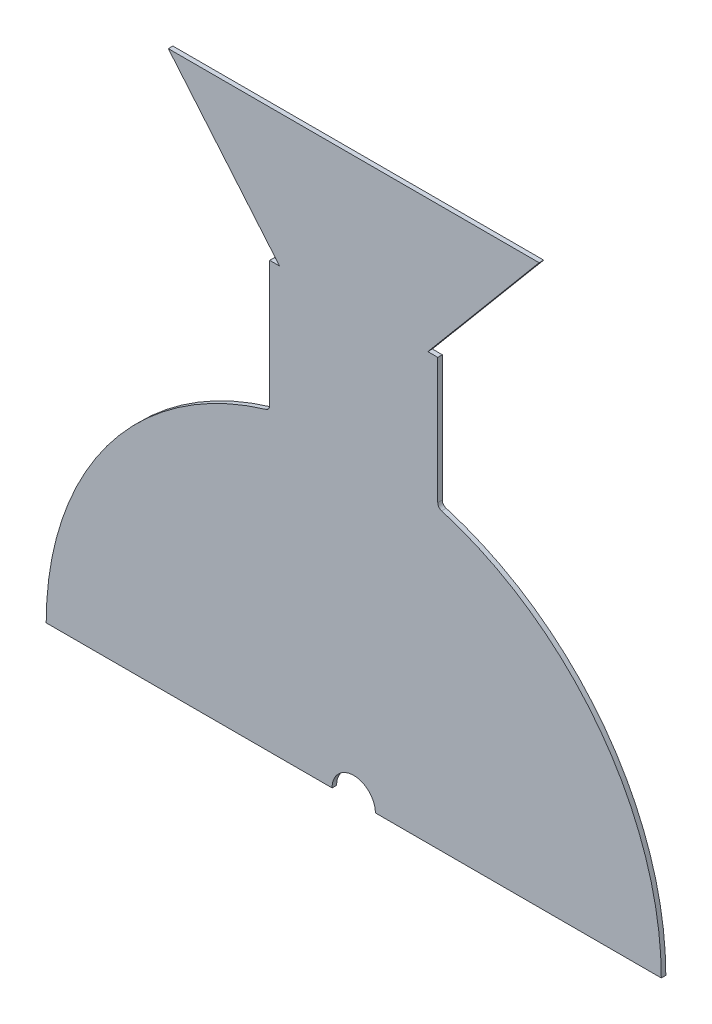
ISO-10303-21;
HEADER;
FILE_DESCRIPTION(('STEP AP214'),'2;1');
FILE_NAME('part.step','',(''),(''),'','','');
FILE_SCHEMA(('AUTOMOTIVE_DESIGN { 1 0 10303 214 1 1 1 1 }'));
ENDSEC;
DATA;
#1=APPLICATION_CONTEXT('core data for automotive mechanical design processes');
#2=APPLICATION_PROTOCOL_DEFINITION('international standard','automotive_design',2000,#1);
#3=PRODUCT_CONTEXT('',#1,'mechanical');
#4=PRODUCT('Part','Part','',(#3));
#5=PRODUCT_RELATED_PRODUCT_CATEGORY('part','',(#4));
#6=PRODUCT_DEFINITION_FORMATION('','',#4);
#7=PRODUCT_DEFINITION_CONTEXT('part definition',#1,'design');
#8=PRODUCT_DEFINITION('design','',#6,#7);
#9=PRODUCT_DEFINITION_SHAPE('','',#8);
#10=(LENGTH_UNIT() NAMED_UNIT(*) SI_UNIT(.MILLI.,.METRE.));
#11=(NAMED_UNIT(*) PLANE_ANGLE_UNIT() SI_UNIT($,.RADIAN.));
#12=(NAMED_UNIT(*) SI_UNIT($,.STERADIAN.) SOLID_ANGLE_UNIT());
#13=UNCERTAINTY_MEASURE_WITH_UNIT(LENGTH_MEASURE(1.E-05),#10,'distance_accuracy_value','');
#14=(GEOMETRIC_REPRESENTATION_CONTEXT(3) GLOBAL_UNCERTAINTY_ASSIGNED_CONTEXT((#13)) GLOBAL_UNIT_ASSIGNED_CONTEXT((#10,
#11,#12)) REPRESENTATION_CONTEXT('',''));
#15=CARTESIAN_POINT('',(0.,0.,0.));
#16=DIRECTION('',(0.,0.,1.));
#17=DIRECTION('',(1.,0.,0.));
#18=AXIS2_PLACEMENT_3D('',#15,#16,#17);
#19=CARTESIAN_POINT('',(0.,0.,-2.65684));
#20=DIRECTION('',(0.,0.,1.));
#21=DIRECTION('',(1.,0.,0.));
#22=AXIS2_PLACEMENT_3D('',#19,#20,#21);
#23=CYLINDRICAL_SURFACE('',#22,180.45684);
#24=CARTESIAN_POINT('',(0.,0.,0.));
#25=DIRECTION('',(0.,0.,1.));
#26=DIRECTION('',(-1.,0.,0.));
#27=AXIS2_PLACEMENT_3D('',#24,#25,#26);
#28=CIRCLE('',#27,180.45684);
#29=CARTESIAN_POINT('',(-51.5590971428571,172.934469104916,0.));
#30=VERTEX_POINT('',#29);
#31=CARTESIAN_POINT('',(-180.45684,0.,0.));
#32=VERTEX_POINT('',#31);
#33=EDGE_CURVE('E187',#30,#32,#28,.T.);
#34=ORIENTED_EDGE('',*,*,#33,.F.);
#35=DIRECTION('',(0.,0.,1.));
#36=VECTOR('',#35,1.);
#37=CARTESIAN_POINT('',(-51.5590971428571,172.934469104916,-2.65684));
#38=LINE('',#37,#36);
#39=CARTESIAN_POINT('',(-51.5590971428571,172.934469104916,-2.65684));
#40=VERTEX_POINT('',#39);
#41=EDGE_CURVE('E54',#30,#40,#38,.F.);
#42=ORIENTED_EDGE('',*,*,#41,.T.);
#43=CARTESIAN_POINT('',(0.,0.,-2.65684));
#44=DIRECTION('',(0.,0.,1.));
#45=DIRECTION('',(-1.,0.,0.));
#46=AXIS2_PLACEMENT_3D('',#43,#44,#45);
#47=CIRCLE('',#46,180.45684);
#48=CARTESIAN_POINT('',(-180.45684,0.,-2.65684));
#49=VERTEX_POINT('',#48);
#50=EDGE_CURVE('E136',#40,#49,#47,.T.);
#51=ORIENTED_EDGE('',*,*,#50,.T.);
#52=DIRECTION('',(0.,0.,1.));
#53=VECTOR('',#52,1.);
#54=CARTESIAN_POINT('',(-180.45684,0.,-2.65684));
#55=LINE('',#54,#53);
#56=EDGE_CURVE('E138',#49,#32,#55,.T.);
#57=ORIENTED_EDGE('',*,*,#56,.T.);
#58=EDGE_LOOP('',(#34,#42,#51,#57));
#59=FACE_BOUND('',#58,.T.);
#60=ADVANCED_FACE('F39',(#59),#23,.T.);
#61=CARTESIAN_POINT('',(-49.29124,173.594483674015,-2.65684));
#62=DIRECTION('',(-1.,0.,0.));
#63=DIRECTION('',(0.,0.,1.));
#64=AXIS2_PLACEMENT_3D('',#61,#62,#63);
#65=PLANE('',#64);
#66=DIRECTION('',(0.,-1.,0.));
#67=VECTOR('',#66,1.);
#68=CARTESIAN_POINT('',(-49.29124,173.594483674015,-2.65684));
#69=LINE('',#68,#67);
#70=CARTESIAN_POINT('',(-49.29124,249.794483674015,-2.65684));
#71=VERTEX_POINT('',#70);
#72=CARTESIAN_POINT('',(-49.29124,175.977118745728,-2.65684));
#73=VERTEX_POINT('',#72);
#74=EDGE_CURVE('E152',#71,#73,#69,.T.);
#75=ORIENTED_EDGE('',*,*,#74,.T.);
#76=DIRECTION('',(0.,0.,-1.));
#77=VECTOR('',#76,1.);
#78=CARTESIAN_POINT('',(-49.29124,175.977118745728,0.));
#79=LINE('',#78,#77);
#80=CARTESIAN_POINT('',(-49.29124,175.977118745728,0.));
#81=VERTEX_POINT('',#80);
#82=EDGE_CURVE('E240',#73,#81,#79,.F.);
#83=ORIENTED_EDGE('',*,*,#82,.T.);
#84=DIRECTION('',(0.,-1.,0.));
#85=VECTOR('',#84,1.);
#86=CARTESIAN_POINT('',(-49.29124,173.594483674015,0.));
#87=LINE('',#86,#85);
#88=CARTESIAN_POINT('',(-49.29124,249.794483674015,0.));
#89=VERTEX_POINT('',#88);
#90=EDGE_CURVE('E144',#89,#81,#87,.T.);
#91=ORIENTED_EDGE('',*,*,#90,.F.);
#92=DIRECTION('',(0.,0.,1.));
#93=VECTOR('',#92,1.);
#94=CARTESIAN_POINT('',(-49.29124,249.794483674015,-2.65684));
#95=LINE('',#94,#93);
#96=EDGE_CURVE('E217',#71,#89,#95,.T.);
#97=ORIENTED_EDGE('',*,*,#96,.F.);
#98=EDGE_LOOP('',(#75,#83,#91,#97));
#99=FACE_BOUND('',#98,.T.);
#100=ADVANCED_FACE('F282',(#99),#65,.T.);
#101=CARTESIAN_POINT('',(-43.4887045989181,249.794483674015,-2.65684));
#102=DIRECTION('',(0.,1.,0.));
#103=DIRECTION('',(0.,0.,1.));
#104=AXIS2_PLACEMENT_3D('',#101,#102,#103);
#105=PLANE('',#104);
#106=DIRECTION('',(-1.,0.,0.));
#107=VECTOR('',#106,1.);
#108=CARTESIAN_POINT('',(-43.4887045989181,249.794483674015,0.));
#109=LINE('',#108,#107);
#110=CARTESIAN_POINT('',(-43.4887045989181,249.794483674015,0.));
#111=VERTEX_POINT('',#110);
#112=EDGE_CURVE('E213',#111,#89,#109,.T.);
#113=ORIENTED_EDGE('',*,*,#112,.F.);
#114=DIRECTION('',(0.,0.,1.));
#115=VECTOR('',#114,1.);
#116=CARTESIAN_POINT('',(-43.4887045989181,249.794483674015,-2.65684));
#117=LINE('',#116,#115);
#118=CARTESIAN_POINT('',(-43.4887045989181,249.794483674015,-2.65684));
#119=VERTEX_POINT('',#118);
#120=EDGE_CURVE('E220',#119,#111,#117,.T.);
#121=ORIENTED_EDGE('',*,*,#120,.F.);
#122=DIRECTION('',(-1.,0.,0.));
#123=VECTOR('',#122,1.);
#124=CARTESIAN_POINT('',(-43.4887045989181,249.794483674015,-2.65684));
#125=LINE('',#124,#123);
#126=EDGE_CURVE('E182',#119,#71,#125,.T.);
#127=ORIENTED_EDGE('',*,*,#126,.T.);
#128=ORIENTED_EDGE('',*,*,#96,.T.);
#129=EDGE_LOOP('',(#113,#121,#127,#128));
#130=FACE_BOUND('',#129,.T.);
#131=ADVANCED_FACE('F287',(#130),#105,.T.);
#132=CARTESIAN_POINT('',(-108.795925743071,327.624599094903,-2.65684));
#133=DIRECTION('',(-0.766044443118977,-0.642787609686541,0.));
#134=DIRECTION('',(0.642787609686541,-0.766044443118977,0.));
#135=AXIS2_PLACEMENT_3D('',#132,#133,#134);
#136=PLANE('',#135);
#137=DIRECTION('',(0.642787609686541,-0.766044443118977,0.));
#138=VECTOR('',#137,1.);
#139=CARTESIAN_POINT('',(-108.795925743071,327.624599094903,0.));
#140=LINE('',#139,#138);
#141=CARTESIAN_POINT('',(-108.795925743071,327.624599094903,0.));
#142=VERTEX_POINT('',#141);
#143=EDGE_CURVE('E210',#142,#111,#140,.T.);
#144=ORIENTED_EDGE('',*,*,#143,.F.);
#145=DIRECTION('',(0.,0.,1.));
#146=VECTOR('',#145,1.);
#147=CARTESIAN_POINT('',(-108.795925743071,327.624599094903,-2.65684));
#148=LINE('',#147,#146);
#149=CARTESIAN_POINT('',(-108.795925743071,327.624599094903,-2.65684));
#150=VERTEX_POINT('',#149);
#151=EDGE_CURVE('E222',#150,#142,#148,.T.);
#152=ORIENTED_EDGE('',*,*,#151,.F.);
#153=DIRECTION('',(0.642787609686541,-0.766044443118977,0.));
#154=VECTOR('',#153,1.);
#155=CARTESIAN_POINT('',(-108.795925743071,327.624599094903,-2.65684));
#156=LINE('',#155,#154);
#157=EDGE_CURVE('E179',#150,#119,#156,.T.);
#158=ORIENTED_EDGE('',*,*,#157,.T.);
#159=ORIENTED_EDGE('',*,*,#120,.T.);
#160=EDGE_LOOP('',(#144,#152,#158,#159));
#161=FACE_BOUND('',#160,.T.);
#162=ADVANCED_FACE('F277',(#161),#136,.T.);
#163=CARTESIAN_POINT('',(-108.795925743071,327.624599094903,-2.65684));
#164=DIRECTION('',(0.,1.,0.));
#165=DIRECTION('',(0.,0.,1.));
#166=AXIS2_PLACEMENT_3D('',#163,#164,#165);
#167=PLANE('',#166);
#168=DIRECTION('',(-1.,0.,0.));
#169=VECTOR('',#168,1.);
#170=CARTESIAN_POINT('',(-108.795925743071,327.624599094903,0.));
#171=LINE('',#170,#169);
#172=CARTESIAN_POINT('',(108.795925743071,327.624599094903,0.));
#173=VERTEX_POINT('',#172);
#174=EDGE_CURVE('E207',#173,#142,#171,.T.);
#175=ORIENTED_EDGE('',*,*,#174,.F.);
#176=DIRECTION('',(0.,0.,1.));
#177=VECTOR('',#176,1.);
#178=CARTESIAN_POINT('',(108.795925743071,327.624599094903,-2.65684));
#179=LINE('',#178,#177);
#180=CARTESIAN_POINT('',(108.795925743071,327.624599094903,-2.65684));
#181=VERTEX_POINT('',#180);
#182=EDGE_CURVE('E224',#181,#173,#179,.T.);
#183=ORIENTED_EDGE('',*,*,#182,.F.);
#184=DIRECTION('',(-1.,0.,0.));
#185=VECTOR('',#184,1.);
#186=CARTESIAN_POINT('',(-108.795925743071,327.624599094903,-2.65684));
#187=LINE('',#186,#185);
#188=EDGE_CURVE('E176',#181,#150,#187,.T.);
#189=ORIENTED_EDGE('',*,*,#188,.T.);
#190=ORIENTED_EDGE('',*,*,#151,.T.);
#191=EDGE_LOOP('',(#175,#183,#189,#190));
#192=FACE_BOUND('',#191,.T.);
#193=ADVANCED_FACE('F273',(#192),#167,.T.);
#194=CARTESIAN_POINT('',(43.4887045989181,249.794483674015,-2.65684));
#195=DIRECTION('',(0.766044443118977,-0.642787609686541,0.));
#196=DIRECTION('',(0.642787609686541,0.766044443118977,0.));
#197=AXIS2_PLACEMENT_3D('',#194,#195,#196);
#198=PLANE('',#197);
#199=DIRECTION('',(0.642787609686541,0.766044443118977,0.));
#200=VECTOR('',#199,1.);
#201=CARTESIAN_POINT('',(43.4887045989181,249.794483674015,0.));
#202=LINE('',#201,#200);
#203=CARTESIAN_POINT('',(43.4887045989181,249.794483674015,0.));
#204=VERTEX_POINT('',#203);
#205=EDGE_CURVE('E204',#204,#173,#202,.T.);
#206=ORIENTED_EDGE('',*,*,#205,.F.);
#207=DIRECTION('',(0.,0.,1.));
#208=VECTOR('',#207,1.);
#209=CARTESIAN_POINT('',(43.4887045989181,249.794483674015,-2.65684));
#210=LINE('',#209,#208);
#211=CARTESIAN_POINT('',(43.4887045989181,249.794483674015,-2.65684));
#212=VERTEX_POINT('',#211);
#213=EDGE_CURVE('E226',#212,#204,#210,.T.);
#214=ORIENTED_EDGE('',*,*,#213,.F.);
#215=DIRECTION('',(0.642787609686541,0.766044443118977,0.));
#216=VECTOR('',#215,1.);
#217=CARTESIAN_POINT('',(43.4887045989181,249.794483674015,-2.65684));
#218=LINE('',#217,#216);
#219=EDGE_CURVE('E173',#212,#181,#218,.T.);
#220=ORIENTED_EDGE('',*,*,#219,.T.);
#221=ORIENTED_EDGE('',*,*,#182,.T.);
#222=EDGE_LOOP('',(#206,#214,#220,#221));
#223=FACE_BOUND('',#222,.T.);
#224=ADVANCED_FACE('F269',(#223),#198,.T.);
#225=CARTESIAN_POINT('',(43.4887045989181,249.794483674015,-2.65684));
#226=DIRECTION('',(0.,1.,0.));
#227=DIRECTION('',(0.,0.,1.));
#228=AXIS2_PLACEMENT_3D('',#225,#226,#227);
#229=PLANE('',#228);
#230=DIRECTION('',(-1.,0.,0.));
#231=VECTOR('',#230,1.);
#232=CARTESIAN_POINT('',(43.4887045989181,249.794483674015,0.));
#233=LINE('',#232,#231);
#234=CARTESIAN_POINT('',(49.29124,249.794483674015,0.));
#235=VERTEX_POINT('',#234);
#236=EDGE_CURVE('E201',#235,#204,#233,.T.);
#237=ORIENTED_EDGE('',*,*,#236,.F.);
#238=DIRECTION('',(0.,0.,1.));
#239=VECTOR('',#238,1.);
#240=CARTESIAN_POINT('',(49.29124,249.794483674015,-2.65684));
#241=LINE('',#240,#239);
#242=CARTESIAN_POINT('',(49.29124,249.794483674015,-2.65684));
#243=VERTEX_POINT('',#242);
#244=EDGE_CURVE('E228',#243,#235,#241,.T.);
#245=ORIENTED_EDGE('',*,*,#244,.F.);
#246=DIRECTION('',(-1.,0.,0.));
#247=VECTOR('',#246,1.);
#248=CARTESIAN_POINT('',(43.4887045989181,249.794483674015,-2.65684));
#249=LINE('',#248,#247);
#250=EDGE_CURVE('E170',#243,#212,#249,.T.);
#251=ORIENTED_EDGE('',*,*,#250,.T.);
#252=ORIENTED_EDGE('',*,*,#213,.T.);
#253=EDGE_LOOP('',(#237,#245,#251,#252));
#254=FACE_BOUND('',#253,.T.);
#255=ADVANCED_FACE('F265',(#254),#229,.T.);
#256=CARTESIAN_POINT('',(49.29124,173.594483674015,-2.65684));
#257=DIRECTION('',(1.,0.,0.));
#258=DIRECTION('',(0.,0.,-1.));
#259=AXIS2_PLACEMENT_3D('',#256,#257,#258);
#260=PLANE('',#259);
#261=DIRECTION('',(0.,1.,0.));
#262=VECTOR('',#261,1.);
#263=CARTESIAN_POINT('',(49.29124,173.594483674015,0.));
#264=LINE('',#263,#262);
#265=CARTESIAN_POINT('',(49.29124,175.977118745728,0.));
#266=VERTEX_POINT('',#265);
#267=EDGE_CURVE('E199',#266,#235,#264,.T.);
#268=ORIENTED_EDGE('',*,*,#267,.F.);
#269=DIRECTION('',(0.,0.,-1.));
#270=VECTOR('',#269,1.);
#271=CARTESIAN_POINT('',(49.29124,175.977118745728,-2.65684));
#272=LINE('',#271,#270);
#273=CARTESIAN_POINT('',(49.29124,175.977118745728,-2.65684));
#274=VERTEX_POINT('',#273);
#275=EDGE_CURVE('E238',#266,#274,#272,.T.);
#276=ORIENTED_EDGE('',*,*,#275,.T.);
#277=DIRECTION('',(0.,1.,0.));
#278=VECTOR('',#277,1.);
#279=CARTESIAN_POINT('',(49.29124,173.594483674015,-2.65684));
#280=LINE('',#279,#278);
#281=EDGE_CURVE('E168',#274,#243,#280,.T.);
#282=ORIENTED_EDGE('',*,*,#281,.T.);
#283=ORIENTED_EDGE('',*,*,#244,.T.);
#284=EDGE_LOOP('',(#268,#276,#282,#283));
#285=FACE_BOUND('',#284,.T.);
#286=ADVANCED_FACE('F261',(#285),#260,.T.);
#287=CARTESIAN_POINT('',(0.,0.,-2.65684));
#288=DIRECTION('',(0.,0.,1.));
#289=DIRECTION('',(1.,0.,0.));
#290=AXIS2_PLACEMENT_3D('',#287,#288,#289);
#291=CYLINDRICAL_SURFACE('',#290,180.45684);
#292=CARTESIAN_POINT('',(0.,0.,-2.65684));
#293=DIRECTION('',(0.,0.,1.));
#294=DIRECTION('',(-1.,0.,0.));
#295=AXIS2_PLACEMENT_3D('',#292,#293,#294);
#296=CIRCLE('',#295,180.45684);
#297=CARTESIAN_POINT('',(180.45684,0.,-2.65684));
#298=VERTEX_POINT('',#297);
#299=CARTESIAN_POINT('',(51.5590971428571,172.934469104916,-2.65684));
#300=VERTEX_POINT('',#299);
#301=EDGE_CURVE('E165',#298,#300,#296,.T.);
#302=ORIENTED_EDGE('',*,*,#301,.T.);
#303=DIRECTION('',(0.,0.,1.));
#304=VECTOR('',#303,1.);
#305=CARTESIAN_POINT('',(51.5590971428571,172.934469104916,-2.65684));
#306=LINE('',#305,#304);
#307=CARTESIAN_POINT('',(51.5590971428571,172.934469104916,0.));
#308=VERTEX_POINT('',#307);
#309=EDGE_CURVE('E219',#300,#308,#306,.T.);
#310=ORIENTED_EDGE('',*,*,#309,.T.);
#311=CARTESIAN_POINT('',(0.,0.,0.));
#312=DIRECTION('',(0.,0.,1.));
#313=DIRECTION('',(-1.,0.,0.));
#314=AXIS2_PLACEMENT_3D('',#311,#312,#313);
#315=CIRCLE('',#314,180.45684);
#316=CARTESIAN_POINT('',(180.45684,0.,0.));
#317=VERTEX_POINT('',#316);
#318=EDGE_CURVE('E196',#317,#308,#315,.T.);
#319=ORIENTED_EDGE('',*,*,#318,.F.);
#320=DIRECTION('',(0.,0.,1.));
#321=VECTOR('',#320,1.);
#322=CARTESIAN_POINT('',(180.45684,0.,-2.65684));
#323=LINE('',#322,#321);
#324=EDGE_CURVE('E231',#298,#317,#323,.T.);
#325=ORIENTED_EDGE('',*,*,#324,.F.);
#326=EDGE_LOOP('',(#302,#310,#319,#325));
#327=FACE_BOUND('',#326,.T.);
#328=ADVANCED_FACE('F255',(#327),#291,.T.);
#329=CARTESIAN_POINT('',(12.7,0.,-2.65684));
#330=DIRECTION('',(0.,-1.,0.));
#331=DIRECTION('',(1.,0.,0.));
#332=AXIS2_PLACEMENT_3D('',#329,#330,#331);
#333=PLANE('',#332);
#334=DIRECTION('',(1.,0.,0.));
#335=VECTOR('',#334,1.);
#336=CARTESIAN_POINT('',(12.7,0.,0.));
#337=LINE('',#336,#335);
#338=CARTESIAN_POINT('',(12.7,0.,0.));
#339=VERTEX_POINT('',#338);
#340=EDGE_CURVE('E193',#339,#317,#337,.T.);
#341=ORIENTED_EDGE('',*,*,#340,.F.);
#342=DIRECTION('',(0.,0.,1.));
#343=VECTOR('',#342,1.);
#344=CARTESIAN_POINT('',(12.7,0.,-2.65684));
#345=LINE('',#344,#343);
#346=CARTESIAN_POINT('',(12.7,0.,-2.65684));
#347=VERTEX_POINT('',#346);
#348=EDGE_CURVE('E233',#347,#339,#345,.T.);
#349=ORIENTED_EDGE('',*,*,#348,.F.);
#350=DIRECTION('',(1.,0.,0.));
#351=VECTOR('',#350,1.);
#352=CARTESIAN_POINT('',(12.7,0.,-2.65684));
#353=LINE('',#352,#351);
#354=EDGE_CURVE('E160',#347,#298,#353,.T.);
#355=ORIENTED_EDGE('',*,*,#354,.T.);
#356=ORIENTED_EDGE('',*,*,#324,.T.);
#357=EDGE_LOOP('',(#341,#349,#355,#356));
#358=FACE_BOUND('',#357,.T.);
#359=ADVANCED_FACE('F319',(#358),#333,.T.);
#360=CARTESIAN_POINT('',(0.,0.,-2.65684));
#361=DIRECTION('',(0.,0.,1.));
#362=DIRECTION('',(1.,0.,0.));
#363=AXIS2_PLACEMENT_3D('',#360,#361,#362);
#364=CYLINDRICAL_SURFACE('',#363,12.7);
#365=CARTESIAN_POINT('',(0.,0.,0.));
#366=DIRECTION('',(0.,0.,-1.));
#367=DIRECTION('',(-1.,0.,0.));
#368=AXIS2_PLACEMENT_3D('',#365,#366,#367);
#369=CIRCLE('',#368,12.7);
#370=CARTESIAN_POINT('',(-12.7,0.,0.));
#371=VERTEX_POINT('',#370);
#372=EDGE_CURVE('E190',#371,#339,#369,.T.);
#373=ORIENTED_EDGE('',*,*,#372,.F.);
#374=DIRECTION('',(0.,0.,1.));
#375=VECTOR('',#374,1.);
#376=CARTESIAN_POINT('',(-12.7,0.,-2.65684));
#377=LINE('',#376,#375);
#378=CARTESIAN_POINT('',(-12.7,0.,-2.65684));
#379=VERTEX_POINT('',#378);
#380=EDGE_CURVE('E151',#379,#371,#377,.T.);
#381=ORIENTED_EDGE('',*,*,#380,.F.);
#382=CARTESIAN_POINT('',(0.,0.,-2.65684));
#383=DIRECTION('',(0.,0.,-1.));
#384=DIRECTION('',(-1.,0.,0.));
#385=AXIS2_PLACEMENT_3D('',#382,#383,#384);
#386=CIRCLE('',#385,12.7);
#387=EDGE_CURVE('E158',#379,#347,#386,.T.);
#388=ORIENTED_EDGE('',*,*,#387,.T.);
#389=ORIENTED_EDGE('',*,*,#348,.T.);
#390=EDGE_LOOP('',(#373,#381,#388,#389));
#391=FACE_BOUND('',#390,.T.);
#392=ADVANCED_FACE('F315',(#391),#364,.F.);
#393=CARTESIAN_POINT('',(-180.45684,0.,-2.65684));
#394=DIRECTION('',(0.,-1.,0.));
#395=DIRECTION('',(1.,0.,0.));
#396=AXIS2_PLACEMENT_3D('',#393,#394,#395);
#397=PLANE('',#396);
#398=DIRECTION('',(1.,0.,0.));
#399=VECTOR('',#398,1.);
#400=CARTESIAN_POINT('',(-180.45684,0.,0.));
#401=LINE('',#400,#399);
#402=EDGE_CURVE('E150',#32,#371,#401,.T.);
#403=ORIENTED_EDGE('',*,*,#402,.F.);
#404=ORIENTED_EDGE('',*,*,#56,.F.);
#405=DIRECTION('',(1.,0.,0.));
#406=VECTOR('',#405,1.);
#407=CARTESIAN_POINT('',(-180.45684,0.,-2.65684));
#408=LINE('',#407,#406);
#409=EDGE_CURVE('E143',#49,#379,#408,.T.);
#410=ORIENTED_EDGE('',*,*,#409,.T.);
#411=ORIENTED_EDGE('',*,*,#380,.T.);
#412=EDGE_LOOP('',(#403,#404,#410,#411));
#413=FACE_BOUND('',#412,.T.);
#414=ADVANCED_FACE('F148',(#413),#397,.T.);
#415=CARTESIAN_POINT('',(0.,0.,-2.65684));
#416=DIRECTION('',(0.,0.,-1.));
#417=DIRECTION('',(-1.,0.,0.));
#418=AXIS2_PLACEMENT_3D('',#415,#416,#417);
#419=PLANE('',#418);
#420=ORIENTED_EDGE('',*,*,#50,.F.);
#421=CARTESIAN_POINT('',(-52.46624,175.977118745728,-2.65684));
#422=DIRECTION('',(0.,0.,-1.));
#423=DIRECTION('',(-1.,0.,0.));
#424=AXIS2_PLACEMENT_3D('',#421,#422,#423);
#425=CIRCLE('',#424,3.175);
#426=EDGE_CURVE('E11',#40,#73,#425,.F.);
#427=ORIENTED_EDGE('',*,*,#426,.T.);
#428=ORIENTED_EDGE('',*,*,#74,.F.);
#429=ORIENTED_EDGE('',*,*,#126,.F.);
#430=ORIENTED_EDGE('',*,*,#157,.F.);
#431=ORIENTED_EDGE('',*,*,#188,.F.);
#432=ORIENTED_EDGE('',*,*,#219,.F.);
#433=ORIENTED_EDGE('',*,*,#250,.F.);
#434=ORIENTED_EDGE('',*,*,#281,.F.);
#435=CARTESIAN_POINT('',(52.46624,175.977118745728,-2.65684));
#436=DIRECTION('',(0.,0.,-1.));
#437=DIRECTION('',(-1.,0.,0.));
#438=AXIS2_PLACEMENT_3D('',#435,#436,#437);
#439=CIRCLE('',#438,3.175);
#440=EDGE_CURVE('E246',#274,#300,#439,.F.);
#441=ORIENTED_EDGE('',*,*,#440,.T.);
#442=ORIENTED_EDGE('',*,*,#301,.F.);
#443=ORIENTED_EDGE('',*,*,#354,.F.);
#444=ORIENTED_EDGE('',*,*,#387,.F.);
#445=ORIENTED_EDGE('',*,*,#409,.F.);
#446=EDGE_LOOP('',(#420,#427,#428,#429,#430,#431,#432,#433,#434,#441,#442,#443,#444,#445));
#447=FACE_BOUND('',#446,.T.);
#448=ADVANCED_FACE('F155',(#447),#419,.T.);
#449=CARTESIAN_POINT('',(0.,0.,0.));
#450=DIRECTION('',(0.,0.,-1.));
#451=DIRECTION('',(-1.,0.,0.));
#452=AXIS2_PLACEMENT_3D('',#449,#450,#451);
#453=PLANE('',#452);
#454=ORIENTED_EDGE('',*,*,#90,.T.);
#455=CARTESIAN_POINT('',(-52.46624,175.977118745728,0.));
#456=DIRECTION('',(0.,0.,-1.));
#457=DIRECTION('',(-1.,0.,0.));
#458=AXIS2_PLACEMENT_3D('',#455,#456,#457);
#459=CIRCLE('',#458,3.175);
#460=EDGE_CURVE('E47',#81,#30,#459,.T.);
#461=ORIENTED_EDGE('',*,*,#460,.T.);
#462=ORIENTED_EDGE('',*,*,#33,.T.);
#463=ORIENTED_EDGE('',*,*,#402,.T.);
#464=ORIENTED_EDGE('',*,*,#372,.T.);
#465=ORIENTED_EDGE('',*,*,#340,.T.);
#466=ORIENTED_EDGE('',*,*,#318,.T.);
#467=CARTESIAN_POINT('',(52.46624,175.977118745728,0.));
#468=DIRECTION('',(0.,0.,-1.));
#469=DIRECTION('',(-1.,0.,0.));
#470=AXIS2_PLACEMENT_3D('',#467,#468,#469);
#471=CIRCLE('',#470,3.175);
#472=EDGE_CURVE('E244',#308,#266,#471,.T.);
#473=ORIENTED_EDGE('',*,*,#472,.T.);
#474=ORIENTED_EDGE('',*,*,#267,.T.);
#475=ORIENTED_EDGE('',*,*,#236,.T.);
#476=ORIENTED_EDGE('',*,*,#205,.T.);
#477=ORIENTED_EDGE('',*,*,#174,.T.);
#478=ORIENTED_EDGE('',*,*,#143,.T.);
#479=ORIENTED_EDGE('',*,*,#112,.T.);
#480=EDGE_LOOP('',(#454,#461,#462,#463,#464,#465,#466,#473,#474,#475,#476,#477,#478,#479));
#481=FACE_BOUND('',#480,.T.);
#482=ADVANCED_FACE('F259',(#481),#453,.F.);
#483=CARTESIAN_POINT('',(52.46624,175.977118745728,-2.65684));
#484=DIRECTION('',(0.,0.,1.));
#485=DIRECTION('',(1.,0.,0.));
#486=AXIS2_PLACEMENT_3D('',#483,#484,#485);
#487=CYLINDRICAL_SURFACE('',#486,3.175);
#488=ORIENTED_EDGE('',*,*,#440,.F.);
#489=ORIENTED_EDGE('',*,*,#275,.F.);
#490=ORIENTED_EDGE('',*,*,#472,.F.);
#491=ORIENTED_EDGE('',*,*,#309,.F.);
#492=EDGE_LOOP('',(#488,#489,#490,#491));
#493=FACE_BOUND('',#492,.T.);
#494=ADVANCED_FACE('F257',(#493),#487,.F.);
#495=CARTESIAN_POINT('',(-52.46624,175.977118745728,-2.65684));
#496=DIRECTION('',(0.,0.,1.));
#497=DIRECTION('',(1.,0.,0.));
#498=AXIS2_PLACEMENT_3D('',#495,#496,#497);
#499=CYLINDRICAL_SURFACE('',#498,3.175);
#500=ORIENTED_EDGE('',*,*,#426,.F.);
#501=ORIENTED_EDGE('',*,*,#41,.F.);
#502=ORIENTED_EDGE('',*,*,#460,.F.);
#503=ORIENTED_EDGE('',*,*,#82,.F.);
#504=EDGE_LOOP('',(#500,#501,#502,#503));
#505=FACE_BOUND('',#504,.T.);
#506=ADVANCED_FACE('F41',(#505),#499,.F.);
#507=CLOSED_SHELL('',(#60,#100,#131,#162,#193,#224,#255,#286,#328,#359,#392,#414,#448,#482,#494,#506));
#508=MANIFOLD_SOLID_BREP('B2',#507);
#509=ADVANCED_BREP_SHAPE_REPRESENTATION('',(#18,#508),#14);
#510=SHAPE_DEFINITION_REPRESENTATION(#9,#509);
ENDSEC;
END-ISO-10303-21;
